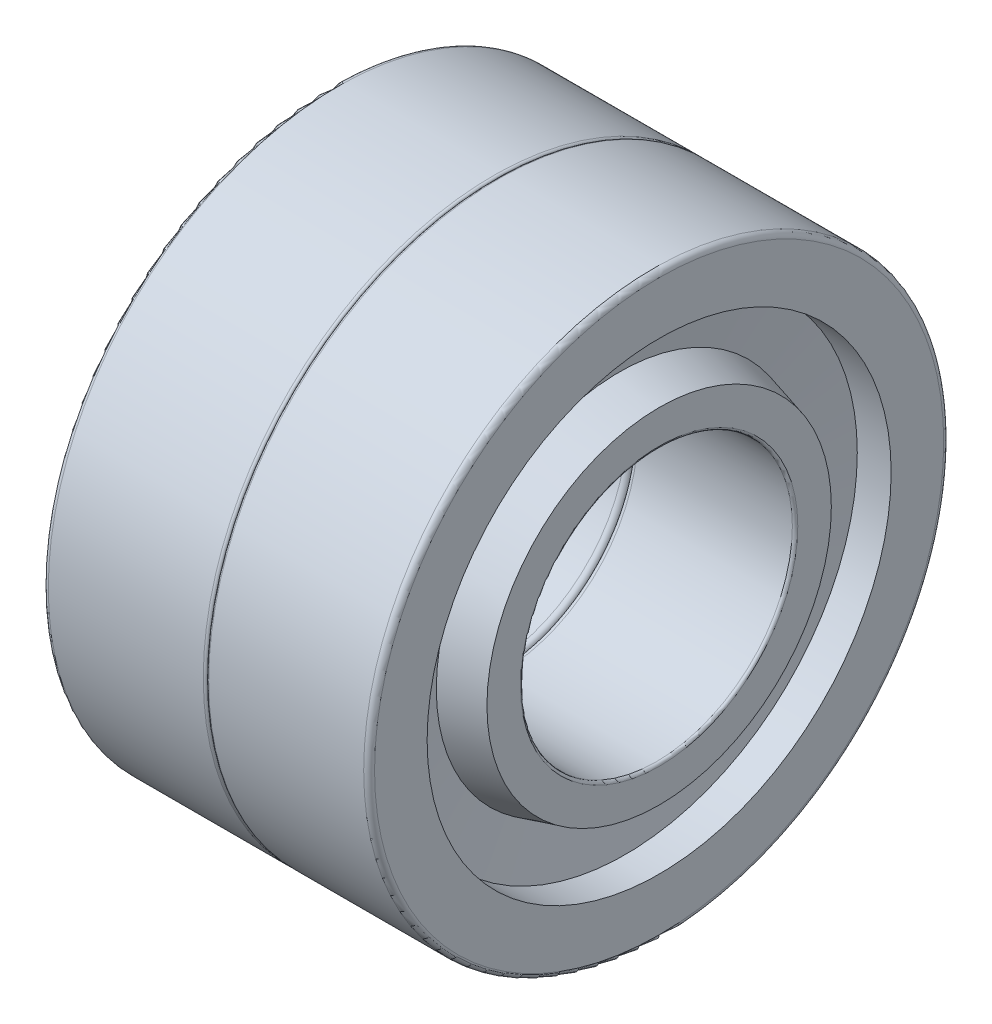
ISO-10303-21;
HEADER;
FILE_DESCRIPTION(('STEP AP214'),'2;1');
FILE_NAME('part.step','',(''),(''),'','','');
FILE_SCHEMA(('AUTOMOTIVE_DESIGN { 1 0 10303 214 1 1 1 1 }'));
ENDSEC;
DATA;
#1=APPLICATION_CONTEXT('core data for automotive mechanical design processes');
#2=APPLICATION_PROTOCOL_DEFINITION('international standard','automotive_design',2000,#1);
#3=PRODUCT_CONTEXT('',#1,'mechanical');
#4=PRODUCT('Part','Part','',(#3));
#5=PRODUCT_RELATED_PRODUCT_CATEGORY('part','',(#4));
#6=PRODUCT_DEFINITION_FORMATION('','',#4);
#7=PRODUCT_DEFINITION_CONTEXT('part definition',#1,'design');
#8=PRODUCT_DEFINITION('design','',#6,#7);
#9=PRODUCT_DEFINITION_SHAPE('','',#8);
#10=(LENGTH_UNIT() NAMED_UNIT(*) SI_UNIT(.MILLI.,.METRE.));
#11=(NAMED_UNIT(*) PLANE_ANGLE_UNIT() SI_UNIT($,.RADIAN.));
#12=(NAMED_UNIT(*) SI_UNIT($,.STERADIAN.) SOLID_ANGLE_UNIT());
#13=UNCERTAINTY_MEASURE_WITH_UNIT(LENGTH_MEASURE(1.E-05),#10,'distance_accuracy_value','');
#14=(GEOMETRIC_REPRESENTATION_CONTEXT(3) GLOBAL_UNCERTAINTY_ASSIGNED_CONTEXT((#13)) GLOBAL_UNIT_ASSIGNED_CONTEXT((#10,
#11,#12)) REPRESENTATION_CONTEXT('',''));
#15=CARTESIAN_POINT('',(0.,0.,0.));
#16=DIRECTION('',(0.,0.,1.));
#17=DIRECTION('',(1.,0.,0.));
#18=AXIS2_PLACEMENT_3D('',#15,#16,#17);
#19=CARTESIAN_POINT('',(9.425,0.,0.));
#20=DIRECTION('',(-1.,0.,0.));
#21=DIRECTION('',(0.,0.,1.));
#22=AXIS2_PLACEMENT_3D('',#19,#20,#21);
#23=CYLINDRICAL_SURFACE('',#22,7.5);
#24=CARTESIAN_POINT('',(13.7,0.,0.));
#25=DIRECTION('',(1.,0.,0.));
#26=DIRECTION('',(0.,0.,1.));
#27=AXIS2_PLACEMENT_3D('',#24,#25,#26);
#28=CIRCLE('',#27,7.5);
#29=CARTESIAN_POINT('',(13.7,0.,7.5));
#30=VERTEX_POINT('',#29);
#31=EDGE_CURVE('E148',#30,#30,#28,.F.);
#32=ORIENTED_EDGE('',*,*,#31,.F.);
#33=EDGE_LOOP('',(#32));
#34=FACE_BOUND('',#33,.T.);
#35=CARTESIAN_POINT('',(5.15,0.,0.));
#36=DIRECTION('',(1.,0.,0.));
#37=DIRECTION('',(0.,0.,1.));
#38=AXIS2_PLACEMENT_3D('',#35,#36,#37);
#39=CIRCLE('',#38,7.5);
#40=CARTESIAN_POINT('',(5.15,0.,7.5));
#41=VERTEX_POINT('',#40);
#42=EDGE_CURVE('E143',#41,#41,#39,.T.);
#43=ORIENTED_EDGE('',*,*,#42,.F.);
#44=EDGE_LOOP('',(#43));
#45=FACE_BOUND('',#44,.T.);
#46=ADVANCED_FACE('F18',(#34,#45),#23,.F.);
#47=CARTESIAN_POINT('',(13.7,0.,0.));
#48=DIRECTION('',(1.,0.,0.));
#49=DIRECTION('',(0.,0.,1.));
#50=AXIS2_PLACEMENT_3D('',#47,#48,#49);
#51=TOROIDAL_SURFACE('',#50,7.8,0.300000000000002);
#52=ORIENTED_EDGE('',*,*,#31,.T.);
#53=EDGE_LOOP('',(#52));
#54=FACE_BOUND('',#53,.T.);
#55=CARTESIAN_POINT('',(14.,0.,0.));
#56=DIRECTION('',(1.,0.,0.));
#57=DIRECTION('',(0.,0.,1.));
#58=AXIS2_PLACEMENT_3D('',#55,#56,#57);
#59=CIRCLE('',#58,7.8);
#60=CARTESIAN_POINT('',(14.,0.,7.8));
#61=VERTEX_POINT('',#60);
#62=EDGE_CURVE('E136',#61,#61,#59,.F.);
#63=ORIENTED_EDGE('',*,*,#62,.F.);
#64=EDGE_LOOP('',(#63));
#65=FACE_BOUND('',#64,.T.);
#66=ADVANCED_FACE('F125',(#54,#65),#51,.T.);
#67=CARTESIAN_POINT('',(5.15,0.,0.));
#68=DIRECTION('',(1.,0.,0.));
#69=DIRECTION('',(0.,0.,1.));
#70=AXIS2_PLACEMENT_3D('',#67,#68,#69);
#71=TOROIDAL_SURFACE('',#70,7.65,0.149999999999999);
#72=ORIENTED_EDGE('',*,*,#42,.T.);
#73=EDGE_LOOP('',(#72));
#74=FACE_BOUND('',#73,.T.);
#75=CARTESIAN_POINT('',(5.,0.,0.));
#76=DIRECTION('',(-1.,0.,0.));
#77=DIRECTION('',(0.,0.,-1.));
#78=AXIS2_PLACEMENT_3D('',#75,#76,#77);
#79=CIRCLE('',#78,7.65);
#80=CARTESIAN_POINT('',(5.,-7.65,0.));
#81=VERTEX_POINT('',#80);
#82=CARTESIAN_POINT('',(5.,0.,-7.65));
#83=VERTEX_POINT('',#82);
#84=EDGE_CURVE('E77',#81,#83,#79,.F.);
#85=ORIENTED_EDGE('',*,*,#84,.F.);
#86=CARTESIAN_POINT('',(5.,0.,0.));
#87=DIRECTION('',(-1.,0.,0.));
#88=DIRECTION('',(0.,-1.,0.));
#89=AXIS2_PLACEMENT_3D('',#86,#87,#88);
#90=CIRCLE('',#89,7.65);
#91=CARTESIAN_POINT('',(5.,0.,7.65));
#92=VERTEX_POINT('',#91);
#93=EDGE_CURVE('E74',#92,#81,#90,.F.);
#94=ORIENTED_EDGE('',*,*,#93,.F.);
#95=CARTESIAN_POINT('',(5.,0.,0.));
#96=DIRECTION('',(-1.,0.,0.));
#97=DIRECTION('',(0.,0.,1.));
#98=AXIS2_PLACEMENT_3D('',#95,#96,#97);
#99=CIRCLE('',#98,7.65);
#100=EDGE_CURVE('E71',#83,#92,#99,.F.);
#101=ORIENTED_EDGE('',*,*,#100,.F.);
#102=EDGE_LOOP('',(#85,#94,#101));
#103=FACE_BOUND('',#102,.T.);
#104=ADVANCED_FACE('F76',(#74,#103),#71,.T.);
#105=CARTESIAN_POINT('',(14.3,0.,0.));
#106=DIRECTION('',(1.,0.,0.));
#107=DIRECTION('',(0.,0.,1.));
#108=AXIS2_PLACEMENT_3D('',#105,#106,#107);
#109=TOROIDAL_SURFACE('',#108,7.8,0.300000000000001);
#110=ORIENTED_EDGE('',*,*,#62,.T.);
#111=EDGE_LOOP('',(#110));
#112=FACE_BOUND('',#111,.T.);
#113=CARTESIAN_POINT('',(14.3,0.,0.));
#114=DIRECTION('',(-1.,0.,0.));
#115=DIRECTION('',(0.,0.,1.));
#116=AXIS2_PLACEMENT_3D('',#113,#114,#115);
#117=CIRCLE('',#116,7.5);
#118=CARTESIAN_POINT('',(14.3,0.,7.5));
#119=VERTEX_POINT('',#118);
#120=EDGE_CURVE('E81',#119,#119,#117,.F.);
#121=ORIENTED_EDGE('',*,*,#120,.T.);
#122=EDGE_LOOP('',(#121));
#123=FACE_BOUND('',#122,.T.);
#124=ADVANCED_FACE('F106',(#112,#123),#109,.T.);
#125=CARTESIAN_POINT('',(5.,-8.575,0.));
#126=DIRECTION('',(-1.,0.,0.));
#127=DIRECTION('',(0.,0.,1.));
#128=AXIS2_PLACEMENT_3D('',#125,#126,#127);
#129=PLANE('',#128);
#130=ORIENTED_EDGE('',*,*,#100,.T.);
#131=ORIENTED_EDGE('',*,*,#93,.T.);
#132=ORIENTED_EDGE('',*,*,#84,.T.);
#133=EDGE_LOOP('',(#130,#131,#132));
#134=FACE_BOUND('',#133,.T.);
#135=CARTESIAN_POINT('',(5.,0.,0.));
#136=DIRECTION('',(1.,0.,0.));
#137=DIRECTION('',(0.,0.,-1.));
#138=AXIS2_PLACEMENT_3D('',#135,#136,#137);
#139=CIRCLE('',#138,9.5);
#140=CARTESIAN_POINT('',(5.,0.,-9.5));
#141=VERTEX_POINT('',#140);
#142=EDGE_CURVE('E120',#141,#141,#139,.T.);
#143=ORIENTED_EDGE('',*,*,#142,.F.);
#144=EDGE_LOOP('',(#143));
#145=FACE_BOUND('',#144,.T.);
#146=ADVANCED_FACE('F85',(#134,#145),#129,.T.);
#147=CARTESIAN_POINT('',(18.575,0.,0.));
#148=DIRECTION('',(-1.,0.,0.));
#149=DIRECTION('',(0.,0.,1.));
#150=AXIS2_PLACEMENT_3D('',#147,#148,#149);
#151=CYLINDRICAL_SURFACE('',#150,7.5);
#152=CARTESIAN_POINT('',(22.85,0.,0.));
#153=DIRECTION('',(1.,0.,0.));
#154=DIRECTION('',(0.,0.,1.));
#155=AXIS2_PLACEMENT_3D('',#152,#153,#154);
#156=CIRCLE('',#155,7.5);
#157=CARTESIAN_POINT('',(22.85,0.,7.5));
#158=VERTEX_POINT('',#157);
#159=EDGE_CURVE('E167',#158,#158,#156,.F.);
#160=ORIENTED_EDGE('',*,*,#159,.F.);
#161=EDGE_LOOP('',(#160));
#162=FACE_BOUND('',#161,.T.);
#163=ORIENTED_EDGE('',*,*,#120,.F.);
#164=EDGE_LOOP('',(#163));
#165=FACE_BOUND('',#164,.T.);
#166=ADVANCED_FACE('F105',(#162,#165),#151,.F.);
#167=CARTESIAN_POINT('',(7.20527231423025,0.,0.));
#168=DIRECTION('',(1.,0.,0.));
#169=DIRECTION('',(0.,0.,-1.));
#170=AXIS2_PLACEMENT_3D('',#167,#168,#169);
#171=CONICAL_SURFACE('',#170,10.0880726171281,0.260602391747341);
#172=CARTESIAN_POINT('',(7.20527231423023,0.,0.));
#173=DIRECTION('',(-1.,0.,0.));
#174=DIRECTION('',(0.,-1.,0.));
#175=AXIS2_PLACEMENT_3D('',#172,#173,#174);
#176=CIRCLE('',#175,10.0880726171281);
#177=CARTESIAN_POINT('',(7.20527231423023,-10.0880726171281,0.));
#178=VERTEX_POINT('',#177);
#179=EDGE_CURVE('E326',#178,#178,#176,.T.);
#180=ORIENTED_EDGE('',*,*,#179,.T.);
#181=EDGE_LOOP('',(#180));
#182=FACE_BOUND('',#181,.T.);
#183=ORIENTED_EDGE('',*,*,#142,.T.);
#184=EDGE_LOOP('',(#183));
#185=FACE_BOUND('',#184,.T.);
#186=ADVANCED_FACE('F311',(#182,#185),#171,.T.);
#187=CARTESIAN_POINT('',(22.85,0.,0.));
#188=DIRECTION('',(1.,0.,0.));
#189=DIRECTION('',(0.,0.,1.));
#190=AXIS2_PLACEMENT_3D('',#187,#188,#189);
#191=TOROIDAL_SURFACE('',#190,7.65,0.150000000000001);
#192=ORIENTED_EDGE('',*,*,#159,.T.);
#193=EDGE_LOOP('',(#192));
#194=FACE_BOUND('',#193,.T.);
#195=CARTESIAN_POINT('',(23.,0.,0.));
#196=DIRECTION('',(1.,0.,0.));
#197=DIRECTION('',(0.,0.,-1.));
#198=AXIS2_PLACEMENT_3D('',#195,#196,#197);
#199=CIRCLE('',#198,7.65);
#200=CARTESIAN_POINT('',(23.,0.,7.65));
#201=VERTEX_POINT('',#200);
#202=CARTESIAN_POINT('',(23.,0.,-7.65));
#203=VERTEX_POINT('',#202);
#204=EDGE_CURVE('E322',#201,#203,#199,.F.);
#205=ORIENTED_EDGE('',*,*,#204,.F.);
#206=CARTESIAN_POINT('',(23.,0.,0.));
#207=DIRECTION('',(1.,0.,0.));
#208=DIRECTION('',(0.,0.,1.));
#209=AXIS2_PLACEMENT_3D('',#206,#207,#208);
#210=CIRCLE('',#209,7.65);
#211=CARTESIAN_POINT('',(23.,-7.65,0.));
#212=VERTEX_POINT('',#211);
#213=EDGE_CURVE('E293',#212,#201,#210,.F.);
#214=ORIENTED_EDGE('',*,*,#213,.F.);
#215=CARTESIAN_POINT('',(23.,0.,0.));
#216=DIRECTION('',(1.,0.,0.));
#217=DIRECTION('',(0.,-1.,0.));
#218=AXIS2_PLACEMENT_3D('',#215,#216,#217);
#219=CIRCLE('',#218,7.65);
#220=EDGE_CURVE('E334',#203,#212,#219,.F.);
#221=ORIENTED_EDGE('',*,*,#220,.F.);
#222=EDGE_LOOP('',(#205,#214,#221));
#223=FACE_BOUND('',#222,.T.);
#224=ADVANCED_FACE('F300',(#194,#223),#191,.T.);
#225=CARTESIAN_POINT('',(6.86840774857164,0.,0.));
#226=DIRECTION('',(-1.,0.,0.));
#227=DIRECTION('',(0.,0.,1.));
#228=AXIS2_PLACEMENT_3D('',#225,#226,#227);
#229=CONICAL_SURFACE('',#228,12.8,1.44721341990413);
#230=CARTESIAN_POINT('',(6.86840774857164,0.,0.));
#231=DIRECTION('',(-1.,0.,0.));
#232=DIRECTION('',(0.,0.,1.));
#233=AXIS2_PLACEMENT_3D('',#230,#231,#232);
#234=CIRCLE('',#233,12.8);
#235=CARTESIAN_POINT('',(6.86840774857164,0.,12.8));
#236=VERTEX_POINT('',#235);
#237=EDGE_CURVE('E164',#236,#236,#234,.T.);
#238=ORIENTED_EDGE('',*,*,#237,.T.);
#239=EDGE_LOOP('',(#238));
#240=FACE_BOUND('',#239,.T.);
#241=ORIENTED_EDGE('',*,*,#179,.F.);
#242=EDGE_LOOP('',(#241));
#243=FACE_BOUND('',#242,.T.);
#244=ADVANCED_FACE('F310',(#240,#243),#229,.F.);
#245=CARTESIAN_POINT('',(23.,-8.575,0.));
#246=DIRECTION('',(1.,0.,0.));
#247=DIRECTION('',(0.,0.,-1.));
#248=AXIS2_PLACEMENT_3D('',#245,#246,#247);
#249=PLANE('',#248);
#250=CARTESIAN_POINT('',(23.,0.,0.));
#251=DIRECTION('',(-1.,0.,0.));
#252=DIRECTION('',(0.,0.,1.));
#253=AXIS2_PLACEMENT_3D('',#250,#251,#252);
#254=CIRCLE('',#253,9.5);
#255=CARTESIAN_POINT('',(23.,0.,9.5));
#256=VERTEX_POINT('',#255);
#257=EDGE_CURVE('E161',#256,#256,#254,.T.);
#258=ORIENTED_EDGE('',*,*,#257,.F.);
#259=EDGE_LOOP('',(#258));
#260=FACE_BOUND('',#259,.T.);
#261=ORIENTED_EDGE('',*,*,#213,.T.);
#262=ORIENTED_EDGE('',*,*,#204,.T.);
#263=ORIENTED_EDGE('',*,*,#220,.T.);
#264=EDGE_LOOP('',(#261,#262,#263));
#265=FACE_BOUND('',#264,.T.);
#266=ADVANCED_FACE('F512',(#260,#265),#249,.T.);
#267=CARTESIAN_POINT('',(5.93420387428582,0.,0.));
#268=DIRECTION('',(-1.,0.,0.));
#269=DIRECTION('',(0.,0.,1.));
#270=AXIS2_PLACEMENT_3D('',#267,#268,#269);
#271=CYLINDRICAL_SURFACE('',#270,12.8);
#272=CARTESIAN_POINT('',(5.,0.,0.));
#273=DIRECTION('',(-1.,0.,0.));
#274=DIRECTION('',(0.,0.,1.));
#275=AXIS2_PLACEMENT_3D('',#272,#273,#274);
#276=CIRCLE('',#275,12.8);
#277=CARTESIAN_POINT('',(5.,0.,12.8));
#278=VERTEX_POINT('',#277);
#279=EDGE_CURVE('E157',#278,#278,#276,.F.);
#280=ORIENTED_EDGE('',*,*,#279,.F.);
#281=EDGE_LOOP('',(#280));
#282=FACE_BOUND('',#281,.T.);
#283=ORIENTED_EDGE('',*,*,#237,.F.);
#284=EDGE_LOOP('',(#283));
#285=FACE_BOUND('',#284,.T.);
#286=ADVANCED_FACE('F502',(#282,#285),#271,.F.);
#287=CARTESIAN_POINT('',(20.7947276857698,0.,0.));
#288=DIRECTION('',(-1.,0.,0.));
#289=DIRECTION('',(0.,0.,1.));
#290=AXIS2_PLACEMENT_3D('',#287,#288,#289);
#291=CONICAL_SURFACE('',#290,10.0880726171281,0.260602391747341);
#292=ORIENTED_EDGE('',*,*,#257,.T.);
#293=EDGE_LOOP('',(#292));
#294=FACE_BOUND('',#293,.T.);
#295=CARTESIAN_POINT('',(20.7947276857698,0.,0.));
#296=DIRECTION('',(1.,0.,0.));
#297=DIRECTION('',(0.,-1.,0.));
#298=AXIS2_PLACEMENT_3D('',#295,#296,#297);
#299=CIRCLE('',#298,10.0880726171281);
#300=CARTESIAN_POINT('',(20.7947276857698,-10.0880726171281,0.));
#301=VERTEX_POINT('',#300);
#302=EDGE_CURVE('E160',#301,#301,#299,.T.);
#303=ORIENTED_EDGE('',*,*,#302,.T.);
#304=EDGE_LOOP('',(#303));
#305=FACE_BOUND('',#304,.T.);
#306=ADVANCED_FACE('F493',(#294,#305),#291,.T.);
#307=CARTESIAN_POINT('',(5.,-14.25,0.));
#308=DIRECTION('',(-1.,0.,0.));
#309=DIRECTION('',(0.,0.,1.));
#310=AXIS2_PLACEMENT_3D('',#307,#308,#309);
#311=PLANE('',#310);
#312=ORIENTED_EDGE('',*,*,#279,.T.);
#313=EDGE_LOOP('',(#312));
#314=FACE_BOUND('',#313,.T.);
#315=CARTESIAN_POINT('',(5.,0.,0.));
#316=DIRECTION('',(1.,0.,0.));
#317=DIRECTION('',(0.,0.,1.));
#318=AXIS2_PLACEMENT_3D('',#315,#316,#317);
#319=CIRCLE('',#318,15.7);
#320=CARTESIAN_POINT('',(5.,0.,15.7));
#321=VERTEX_POINT('',#320);
#322=CARTESIAN_POINT('',(5.,-15.7,0.));
#323=VERTEX_POINT('',#322);
#324=EDGE_CURVE('E745',#321,#323,#319,.T.);
#325=ORIENTED_EDGE('',*,*,#324,.F.);
#326=CARTESIAN_POINT('',(5.,0.,0.));
#327=DIRECTION('',(1.,0.,0.));
#328=DIRECTION('',(0.,0.,-1.));
#329=AXIS2_PLACEMENT_3D('',#326,#327,#328);
#330=CIRCLE('',#329,15.7);
#331=CARTESIAN_POINT('',(5.,0.,-15.7));
#332=VERTEX_POINT('',#331);
#333=EDGE_CURVE('E737',#332,#321,#330,.T.);
#334=ORIENTED_EDGE('',*,*,#333,.F.);
#335=CARTESIAN_POINT('',(5.,0.,0.));
#336=DIRECTION('',(1.,0.,0.));
#337=DIRECTION('',(0.,-1.,0.));
#338=AXIS2_PLACEMENT_3D('',#335,#336,#337);
#339=CIRCLE('',#338,15.7);
#340=EDGE_CURVE('E280',#323,#332,#339,.T.);
#341=ORIENTED_EDGE('',*,*,#340,.F.);
#342=EDGE_LOOP('',(#325,#334,#341));
#343=FACE_BOUND('',#342,.T.);
#344=ADVANCED_FACE('F484',(#314,#343),#311,.T.);
#345=CARTESIAN_POINT('',(21.1315922514284,0.,0.));
#346=DIRECTION('',(1.,0.,0.));
#347=DIRECTION('',(0.,0.,-1.));
#348=AXIS2_PLACEMENT_3D('',#345,#346,#347);
#349=CONICAL_SURFACE('',#348,12.8,1.44721341990413);
#350=ORIENTED_EDGE('',*,*,#302,.F.);
#351=EDGE_LOOP('',(#350));
#352=FACE_BOUND('',#351,.T.);
#353=CARTESIAN_POINT('',(21.1315922514284,0.,0.));
#354=DIRECTION('',(-1.,0.,0.));
#355=DIRECTION('',(0.,0.,1.));
#356=AXIS2_PLACEMENT_3D('',#353,#354,#355);
#357=CIRCLE('',#356,12.8);
#358=CARTESIAN_POINT('',(21.1315922514284,0.,12.8));
#359=VERTEX_POINT('',#358);
#360=EDGE_CURVE('E248',#359,#359,#357,.F.);
#361=ORIENTED_EDGE('',*,*,#360,.T.);
#362=EDGE_LOOP('',(#361));
#363=FACE_BOUND('',#362,.T.);
#364=ADVANCED_FACE('F256',(#352,#363),#349,.F.);
#365=CARTESIAN_POINT('',(5.3,0.,0.));
#366=DIRECTION('',(1.,0.,0.));
#367=DIRECTION('',(0.,0.,1.));
#368=AXIS2_PLACEMENT_3D('',#365,#366,#367);
#369=TOROIDAL_SURFACE('',#368,15.7,0.300000000000004);
#370=CARTESIAN_POINT('',(5.3,0.,0.));
#371=DIRECTION('',(-1.,0.,0.));
#372=DIRECTION('',(0.,0.,1.));
#373=AXIS2_PLACEMENT_3D('',#370,#371,#372);
#374=CIRCLE('',#373,16.);
#375=CARTESIAN_POINT('',(5.3,0.,16.));
#376=VERTEX_POINT('',#375);
#377=EDGE_CURVE('E156',#376,#376,#374,.F.);
#378=ORIENTED_EDGE('',*,*,#377,.F.);
#379=EDGE_LOOP('',(#378));
#380=FACE_BOUND('',#379,.T.);
#381=ORIENTED_EDGE('',*,*,#333,.T.);
#382=ORIENTED_EDGE('',*,*,#324,.T.);
#383=ORIENTED_EDGE('',*,*,#340,.T.);
#384=EDGE_LOOP('',(#381,#382,#383));
#385=FACE_BOUND('',#384,.T.);
#386=ADVANCED_FACE('F251',(#380,#385),#369,.T.);
#387=CARTESIAN_POINT('',(22.0657961257142,0.,0.));
#388=DIRECTION('',(-1.,0.,0.));
#389=DIRECTION('',(0.,0.,1.));
#390=AXIS2_PLACEMENT_3D('',#387,#388,#389);
#391=CYLINDRICAL_SURFACE('',#390,12.8);
#392=ORIENTED_EDGE('',*,*,#360,.F.);
#393=EDGE_LOOP('',(#392));
#394=FACE_BOUND('',#393,.T.);
#395=CARTESIAN_POINT('',(23.,0.,0.));
#396=DIRECTION('',(-1.,0.,0.));
#397=DIRECTION('',(0.,0.,1.));
#398=AXIS2_PLACEMENT_3D('',#395,#396,#397);
#399=CIRCLE('',#398,12.8);
#400=CARTESIAN_POINT('',(23.,0.,12.8));
#401=VERTEX_POINT('',#400);
#402=EDGE_CURVE('E152',#401,#401,#399,.T.);
#403=ORIENTED_EDGE('',*,*,#402,.F.);
#404=EDGE_LOOP('',(#403));
#405=FACE_BOUND('',#404,.T.);
#406=ADVANCED_FACE('F255',(#394,#405),#391,.F.);
#407=CARTESIAN_POINT('',(9.575,0.,0.));
#408=DIRECTION('',(-1.,0.,0.));
#409=DIRECTION('',(0.,0.,1.));
#410=AXIS2_PLACEMENT_3D('',#407,#408,#409);
#411=CYLINDRICAL_SURFACE('',#410,16.);
#412=ORIENTED_EDGE('',*,*,#377,.T.);
#413=EDGE_LOOP('',(#412));
#414=FACE_BOUND('',#413,.T.);
#415=CARTESIAN_POINT('',(13.85,0.,0.));
#416=DIRECTION('',(1.,0.,0.));
#417=DIRECTION('',(0.,0.,1.));
#418=AXIS2_PLACEMENT_3D('',#415,#416,#417);
#419=CIRCLE('',#418,16.);
#420=CARTESIAN_POINT('',(13.85,0.,16.));
#421=VERTEX_POINT('',#420);
#422=EDGE_CURVE('E155',#421,#421,#419,.T.);
#423=ORIENTED_EDGE('',*,*,#422,.F.);
#424=EDGE_LOOP('',(#423));
#425=FACE_BOUND('',#424,.T.);
#426=ADVANCED_FACE('F215',(#414,#425),#411,.T.);
#427=CARTESIAN_POINT('',(23.,-14.25,0.));
#428=DIRECTION('',(1.,0.,0.));
#429=DIRECTION('',(0.,0.,-1.));
#430=AXIS2_PLACEMENT_3D('',#427,#428,#429);
#431=PLANE('',#430);
#432=CARTESIAN_POINT('',(23.,0.,0.));
#433=DIRECTION('',(-1.,0.,0.));
#434=DIRECTION('',(0.,0.,1.));
#435=AXIS2_PLACEMENT_3D('',#432,#433,#434);
#436=CIRCLE('',#435,15.7);
#437=CARTESIAN_POINT('',(23.,0.,15.7));
#438=VERTEX_POINT('',#437);
#439=CARTESIAN_POINT('',(23.,0.,-15.7));
#440=VERTEX_POINT('',#439);
#441=EDGE_CURVE('E233',#438,#440,#436,.T.);
#442=ORIENTED_EDGE('',*,*,#441,.F.);
#443=CARTESIAN_POINT('',(23.,0.,0.));
#444=DIRECTION('',(-1.,0.,0.));
#445=DIRECTION('',(0.,-1.,0.));
#446=AXIS2_PLACEMENT_3D('',#443,#444,#445);
#447=CIRCLE('',#446,15.7);
#448=CARTESIAN_POINT('',(23.,-15.7,0.));
#449=VERTEX_POINT('',#448);
#450=EDGE_CURVE('E231',#449,#438,#447,.T.);
#451=ORIENTED_EDGE('',*,*,#450,.F.);
#452=CARTESIAN_POINT('',(23.,0.,0.));
#453=DIRECTION('',(-1.,0.,0.));
#454=DIRECTION('',(0.,0.,-1.));
#455=AXIS2_PLACEMENT_3D('',#452,#453,#454);
#456=CIRCLE('',#455,15.7);
#457=EDGE_CURVE('E38',#440,#449,#456,.T.);
#458=ORIENTED_EDGE('',*,*,#457,.F.);
#459=EDGE_LOOP('',(#442,#451,#458));
#460=FACE_BOUND('',#459,.T.);
#461=ORIENTED_EDGE('',*,*,#402,.T.);
#462=EDGE_LOOP('',(#461));
#463=FACE_BOUND('',#462,.T.);
#464=ADVANCED_FACE('F206',(#460,#463),#431,.T.);
#465=CARTESIAN_POINT('',(13.85,0.,0.));
#466=DIRECTION('',(1.,0.,0.));
#467=DIRECTION('',(0.,0.,1.));
#468=AXIS2_PLACEMENT_3D('',#465,#466,#467);
#469=TOROIDAL_SURFACE('',#468,15.85,0.149999999999999);
#470=ORIENTED_EDGE('',*,*,#422,.T.);
#471=EDGE_LOOP('',(#470));
#472=FACE_BOUND('',#471,.T.);
#473=CARTESIAN_POINT('',(14.,0.,0.));
#474=DIRECTION('',(1.,0.,0.));
#475=DIRECTION('',(0.,0.,1.));
#476=AXIS2_PLACEMENT_3D('',#473,#474,#475);
#477=CIRCLE('',#476,15.85);
#478=CARTESIAN_POINT('',(14.,0.,15.85));
#479=VERTEX_POINT('',#478);
#480=EDGE_CURVE('E197',#479,#479,#477,.T.);
#481=ORIENTED_EDGE('',*,*,#480,.F.);
#482=EDGE_LOOP('',(#481));
#483=FACE_BOUND('',#482,.T.);
#484=ADVANCED_FACE('F187',(#472,#483),#469,.T.);
#485=CARTESIAN_POINT('',(22.7,0.,0.));
#486=DIRECTION('',(1.,0.,0.));
#487=DIRECTION('',(0.,0.,1.));
#488=AXIS2_PLACEMENT_3D('',#485,#486,#487);
#489=TOROIDAL_SURFACE('',#488,15.7,0.300000000000002);
#490=ORIENTED_EDGE('',*,*,#450,.T.);
#491=ORIENTED_EDGE('',*,*,#441,.T.);
#492=ORIENTED_EDGE('',*,*,#457,.T.);
#493=EDGE_LOOP('',(#490,#491,#492));
#494=FACE_BOUND('',#493,.T.);
#495=CARTESIAN_POINT('',(22.7,0.,0.));
#496=DIRECTION('',(-1.,0.,0.));
#497=DIRECTION('',(0.,0.,1.));
#498=AXIS2_PLACEMENT_3D('',#495,#496,#497);
#499=CIRCLE('',#498,16.);
#500=CARTESIAN_POINT('',(22.7,0.,16.));
#501=VERTEX_POINT('',#500);
#502=EDGE_CURVE('E29',#501,#501,#499,.T.);
#503=ORIENTED_EDGE('',*,*,#502,.F.);
#504=EDGE_LOOP('',(#503));
#505=FACE_BOUND('',#504,.T.);
#506=ADVANCED_FACE('F175',(#494,#505),#489,.T.);
#507=CARTESIAN_POINT('',(14.15,0.,0.));
#508=DIRECTION('',(1.,0.,0.));
#509=DIRECTION('',(0.,0.,1.));
#510=AXIS2_PLACEMENT_3D('',#507,#508,#509);
#511=TOROIDAL_SURFACE('',#510,15.85,0.149999999999999);
#512=ORIENTED_EDGE('',*,*,#480,.T.);
#513=EDGE_LOOP('',(#512));
#514=FACE_BOUND('',#513,.T.);
#515=CARTESIAN_POINT('',(14.15,0.,0.));
#516=DIRECTION('',(-1.,0.,0.));
#517=DIRECTION('',(0.,0.,1.));
#518=AXIS2_PLACEMENT_3D('',#515,#516,#517);
#519=CIRCLE('',#518,16.);
#520=CARTESIAN_POINT('',(14.15,0.,16.));
#521=VERTEX_POINT('',#520);
#522=EDGE_CURVE('E11',#521,#521,#519,.F.);
#523=ORIENTED_EDGE('',*,*,#522,.F.);
#524=EDGE_LOOP('',(#523));
#525=FACE_BOUND('',#524,.T.);
#526=ADVANCED_FACE('F186',(#514,#525),#511,.T.);
#527=CARTESIAN_POINT('',(18.425,0.,0.));
#528=DIRECTION('',(-1.,0.,0.));
#529=DIRECTION('',(0.,0.,1.));
#530=AXIS2_PLACEMENT_3D('',#527,#528,#529);
#531=CYLINDRICAL_SURFACE('',#530,16.);
#532=ORIENTED_EDGE('',*,*,#502,.T.);
#533=EDGE_LOOP('',(#532));
#534=FACE_BOUND('',#533,.T.);
#535=ORIENTED_EDGE('',*,*,#522,.T.);
#536=EDGE_LOOP('',(#535));
#537=FACE_BOUND('',#536,.T.);
#538=ADVANCED_FACE('F347',(#534,#537),#531,.T.);
#539=CLOSED_SHELL('',(#46,#66,#104,#124,#146,#166,#186,#224,#244,#266,#286,#306,#344,#364,#386,
#406,#426,#464,#484,#506,#526,#538));
#540=CARTESIAN_POINT('',(14.,0.,0.));
#541=DIRECTION('',(1.,0.,0.));
#542=DIRECTION('',(0.,0.,-1.));
#543=AXIS2_PLACEMENT_3D('',#540,#541,#542);
#544=CONICAL_SURFACE('',#543,14.,0.260602391747342);
#545=CARTESIAN_POINT('',(14.,0.,0.));
#546=DIRECTION('',(-1.,0.,0.));
#547=DIRECTION('',(0.,-1.,0.));
#548=AXIS2_PLACEMENT_3D('',#545,#546,#547);
#549=CIRCLE('',#548,14.);
#550=CARTESIAN_POINT('',(14.,-14.,0.));
#551=VERTEX_POINT('',#550);
#552=EDGE_CURVE('E392',#551,#551,#549,.F.);
#553=ORIENTED_EDGE('',*,*,#552,.T.);
#554=EDGE_LOOP('',(#553));
#555=FACE_BOUND('',#554,.T.);
#556=CARTESIAN_POINT('',(11.7947276857698,0.,0.));
#557=DIRECTION('',(-1.,0.,0.));
#558=DIRECTION('',(0.,-1.,0.));
#559=AXIS2_PLACEMENT_3D('',#556,#557,#558);
#560=CIRCLE('',#559,13.4119273828719);
#561=CARTESIAN_POINT('',(11.7947276857698,-13.4119273828719,0.));
#562=VERTEX_POINT('',#561);
#563=EDGE_CURVE('E387',#562,#562,#560,.F.);
#564=ORIENTED_EDGE('',*,*,#563,.F.);
#565=EDGE_LOOP('',(#564));
#566=FACE_BOUND('',#565,.T.);
#567=ADVANCED_FACE('F355',(#555,#566),#544,.F.);
#568=CARTESIAN_POINT('',(14.,0.,0.));
#569=DIRECTION('',(-1.,0.,0.));
#570=DIRECTION('',(0.,0.,1.));
#571=AXIS2_PLACEMENT_3D('',#568,#569,#570);
#572=CONICAL_SURFACE('',#571,14.,0.260602391747341);
#573=CARTESIAN_POINT('',(16.2052723142302,0.,0.));
#574=DIRECTION('',(1.,0.,0.));
#575=DIRECTION('',(0.,-1.,0.));
#576=AXIS2_PLACEMENT_3D('',#573,#574,#575);
#577=CIRCLE('',#576,13.4119273828719);
#578=CARTESIAN_POINT('',(16.2052723142302,-13.4119273828719,0.));
#579=VERTEX_POINT('',#578);
#580=EDGE_CURVE('E383',#579,#579,#577,.F.);
#581=ORIENTED_EDGE('',*,*,#580,.F.);
#582=EDGE_LOOP('',(#581));
#583=FACE_BOUND('',#582,.T.);
#584=ORIENTED_EDGE('',*,*,#552,.F.);
#585=EDGE_LOOP('',(#584));
#586=FACE_BOUND('',#585,.T.);
#587=ADVANCED_FACE('F357',(#583,#586),#572,.F.);
#588=CARTESIAN_POINT('',(11.7947276857698,0.,0.));
#589=DIRECTION('',(-1.,0.,0.));
#590=DIRECTION('',(0.,0.,1.));
#591=AXIS2_PLACEMENT_3D('',#588,#589,#590);
#592=CONICAL_SURFACE('',#591,13.4119273828719,1.44721341990413);
#593=ORIENTED_EDGE('',*,*,#563,.T.);
#594=EDGE_LOOP('',(#593));
#595=FACE_BOUND('',#594,.T.);
#596=CARTESIAN_POINT('',(12.1315922514284,0.,0.));
#597=DIRECTION('',(-1.,0.,0.));
#598=DIRECTION('',(0.,0.,1.));
#599=AXIS2_PLACEMENT_3D('',#596,#597,#598);
#600=CIRCLE('',#599,10.7);
#601=CARTESIAN_POINT('',(12.1315922514284,0.,10.7));
#602=VERTEX_POINT('',#601);
#603=EDGE_CURVE('E151',#602,#602,#600,.F.);
#604=ORIENTED_EDGE('',*,*,#603,.F.);
#605=EDGE_LOOP('',(#604));
#606=FACE_BOUND('',#605,.T.);
#607=ADVANCED_FACE('F362',(#595,#606),#592,.T.);
#608=CARTESIAN_POINT('',(16.2052723142302,0.,0.));
#609=DIRECTION('',(1.,0.,0.));
#610=DIRECTION('',(0.,0.,-1.));
#611=AXIS2_PLACEMENT_3D('',#608,#609,#610);
#612=CONICAL_SURFACE('',#611,13.4119273828719,1.44721341990413);
#613=CARTESIAN_POINT('',(15.8684077485716,0.,0.));
#614=DIRECTION('',(-1.,0.,0.));
#615=DIRECTION('',(0.,0.,1.));
#616=AXIS2_PLACEMENT_3D('',#613,#614,#615);
#617=CIRCLE('',#616,10.7);
#618=CARTESIAN_POINT('',(15.8684077485716,0.,10.7));
#619=VERTEX_POINT('',#618);
#620=EDGE_CURVE('E382',#619,#619,#617,.T.);
#621=ORIENTED_EDGE('',*,*,#620,.F.);
#622=EDGE_LOOP('',(#621));
#623=FACE_BOUND('',#622,.T.);
#624=ORIENTED_EDGE('',*,*,#580,.T.);
#625=EDGE_LOOP('',(#624));
#626=FACE_BOUND('',#625,.T.);
#627=ADVANCED_FACE('F366',(#623,#626),#612,.T.);
#628=CARTESIAN_POINT('',(14.,0.,0.));
#629=DIRECTION('',(-1.,0.,0.));
#630=DIRECTION('',(0.,0.,1.));
#631=AXIS2_PLACEMENT_3D('',#628,#629,#630);
#632=CYLINDRICAL_SURFACE('',#631,10.7);
#633=ORIENTED_EDGE('',*,*,#603,.T.);
#634=EDGE_LOOP('',(#633));
#635=FACE_BOUND('',#634,.T.);
#636=ORIENTED_EDGE('',*,*,#620,.T.);
#637=EDGE_LOOP('',(#636));
#638=FACE_BOUND('',#637,.T.);
#639=ADVANCED_FACE('F370',(#635,#638),#632,.T.);
#640=CLOSED_SHELL('',(#567,#587,#607,#627,#639));
#641=ORIENTED_CLOSED_SHELL('',*,#640,.T.);
#642=BREP_WITH_VOIDS('B1',#539,(#641));
#643=ADVANCED_BREP_SHAPE_REPRESENTATION('',(#18,#642),#14);
#644=SHAPE_DEFINITION_REPRESENTATION(#9,#643);
ENDSEC;
END-ISO-10303-21;
